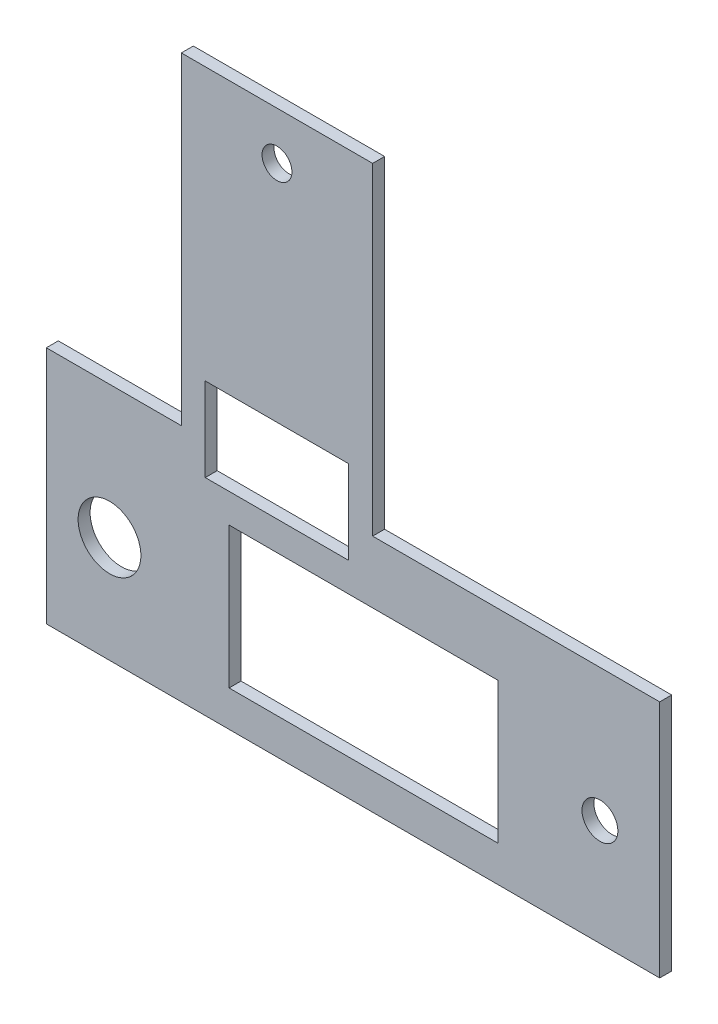
ISO-10303-21;
HEADER;
FILE_DESCRIPTION(('STEP AP214'),'2;1');
FILE_NAME('part.step','',(''),(''),'','','');
FILE_SCHEMA(('AUTOMOTIVE_DESIGN { 1 0 10303 214 1 1 1 1 }'));
ENDSEC;
DATA;
#1=APPLICATION_CONTEXT('core data for automotive mechanical design processes');
#2=APPLICATION_PROTOCOL_DEFINITION('international standard','automotive_design',2000,#1);
#3=PRODUCT_CONTEXT('',#1,'mechanical');
#4=PRODUCT('Part','Part','',(#3));
#5=PRODUCT_RELATED_PRODUCT_CATEGORY('part','',(#4));
#6=PRODUCT_DEFINITION_FORMATION('','',#4);
#7=PRODUCT_DEFINITION_CONTEXT('part definition',#1,'design');
#8=PRODUCT_DEFINITION('design','',#6,#7);
#9=PRODUCT_DEFINITION_SHAPE('','',#8);
#10=(LENGTH_UNIT() NAMED_UNIT(*) SI_UNIT(.MILLI.,.METRE.));
#11=(NAMED_UNIT(*) PLANE_ANGLE_UNIT() SI_UNIT($,.RADIAN.));
#12=(NAMED_UNIT(*) SI_UNIT($,.STERADIAN.) SOLID_ANGLE_UNIT());
#13=UNCERTAINTY_MEASURE_WITH_UNIT(LENGTH_MEASURE(1.E-05),#10,'distance_accuracy_value','');
#14=(GEOMETRIC_REPRESENTATION_CONTEXT(3) GLOBAL_UNCERTAINTY_ASSIGNED_CONTEXT((#13)) GLOBAL_UNIT_ASSIGNED_CONTEXT((#10,
#11,#12)) REPRESENTATION_CONTEXT('',''));
#15=CARTESIAN_POINT('',(0.,0.,0.));
#16=DIRECTION('',(0.,0.,1.));
#17=DIRECTION('',(1.,0.,0.));
#18=AXIS2_PLACEMENT_3D('',#15,#16,#17);
#19=CARTESIAN_POINT('',(0.,0.,1.));
#20=DIRECTION('',(0.,0.,1.));
#21=DIRECTION('',(1.,0.,0.));
#22=AXIS2_PLACEMENT_3D('',#19,#20,#21);
#23=PLANE('',#22);
#24=CARTESIAN_POINT('',(-5.32391187167302,-2.59514563106795,1.));
#25=DIRECTION('',(0.,0.,1.));
#26=DIRECTION('',(1.,0.,0.));
#27=AXIS2_PLACEMENT_3D('',#24,#25,#26);
#28=CIRCLE('',#27,2.625);
#29=CARTESIAN_POINT('',(-2.69891187167302,-2.59514563106795,1.));
#30=VERTEX_POINT('',#29);
#31=EDGE_CURVE('E397',#30,#30,#28,.T.);
#32=ORIENTED_EDGE('',*,*,#31,.F.);
#33=EDGE_LOOP('',(#32));
#34=FACE_BOUND('',#33,.T.);
#35=DIRECTION('',(1.,0.,0.));
#36=VECTOR('',#35,1.);
#37=CARTESIAN_POINT('',(2.68290648419213,5.74613247394495,1.));
#38=LINE('',#37,#36);
#39=CARTESIAN_POINT('',(2.68290648419213,5.74613247394495,1.));
#40=VERTEX_POINT('',#39);
#41=CARTESIAN_POINT('',(14.6829064841921,5.74613247394495,1.));
#42=VERTEX_POINT('',#41);
#43=EDGE_CURVE('E155',#40,#42,#38,.T.);
#44=ORIENTED_EDGE('',*,*,#43,.F.);
#45=DIRECTION('',(0.,-1.,0.));
#46=VECTOR('',#45,1.);
#47=CARTESIAN_POINT('',(2.68290648419213,12.746132473945,1.));
#48=LINE('',#47,#46);
#49=CARTESIAN_POINT('',(2.68290648419213,12.746132473945,1.));
#50=VERTEX_POINT('',#49);
#51=EDGE_CURVE('E147',#50,#40,#48,.T.);
#52=ORIENTED_EDGE('',*,*,#51,.F.);
#53=DIRECTION('',(-1.,0.,0.));
#54=VECTOR('',#53,1.);
#55=CARTESIAN_POINT('',(2.68290648419213,12.746132473945,1.));
#56=LINE('',#55,#54);
#57=CARTESIAN_POINT('',(14.6829064841921,12.746132473945,1.));
#58=VERTEX_POINT('',#57);
#59=EDGE_CURVE('E170',#58,#50,#56,.T.);
#60=ORIENTED_EDGE('',*,*,#59,.F.);
#61=DIRECTION('',(0.,1.,0.));
#62=VECTOR('',#61,1.);
#63=CARTESIAN_POINT('',(14.6829064841921,12.746132473945,1.));
#64=LINE('',#63,#62);
#65=EDGE_CURVE('E168',#42,#58,#64,.T.);
#66=ORIENTED_EDGE('',*,*,#65,.F.);
#67=EDGE_LOOP('',(#44,#52,#60,#66));
#68=FACE_BOUND('',#67,.T.);
#69=DIRECTION('',(1.,0.,0.));
#70=VECTOR('',#69,1.);
#71=CARTESIAN_POINT('',(4.67608812832698,-8.49514563106795,1.));
#72=LINE('',#71,#70);
#73=CARTESIAN_POINT('',(4.67608812832698,-8.49514563106795,1.));
#74=VERTEX_POINT('',#73);
#75=CARTESIAN_POINT('',(27.176088128327,-8.49514563106795,1.));
#76=VERTEX_POINT('',#75);
#77=EDGE_CURVE('E188',#74,#76,#72,.T.);
#78=ORIENTED_EDGE('',*,*,#77,.F.);
#79=DIRECTION('',(0.,-1.,0.));
#80=VECTOR('',#79,1.);
#81=CARTESIAN_POINT('',(4.67608812832698,3.30485436893205,1.));
#82=LINE('',#81,#80);
#83=CARTESIAN_POINT('',(4.67608812832698,3.30485436893205,1.));
#84=VERTEX_POINT('',#83);
#85=EDGE_CURVE('E186',#84,#74,#82,.T.);
#86=ORIENTED_EDGE('',*,*,#85,.F.);
#87=DIRECTION('',(-1.,0.,0.));
#88=VECTOR('',#87,1.);
#89=CARTESIAN_POINT('',(4.67608812832698,3.30485436893205,1.));
#90=LINE('',#89,#88);
#91=CARTESIAN_POINT('',(27.176088128327,3.30485436893205,1.));
#92=VERTEX_POINT('',#91);
#93=EDGE_CURVE('E194',#92,#84,#90,.T.);
#94=ORIENTED_EDGE('',*,*,#93,.F.);
#95=DIRECTION('',(0.,1.,0.));
#96=VECTOR('',#95,1.);
#97=CARTESIAN_POINT('',(27.176088128327,3.30485436893205,1.));
#98=LINE('',#97,#96);
#99=EDGE_CURVE('E191',#76,#92,#98,.T.);
#100=ORIENTED_EDGE('',*,*,#99,.F.);
#101=EDGE_LOOP('',(#78,#86,#94,#100));
#102=FACE_BOUND('',#101,.T.);
#103=DIRECTION('',(0.,-1.,0.));
#104=VECTOR('',#103,1.);
#105=CARTESIAN_POINT('',(-10.6070935158079,8.50485436893205,1.));
#106=LINE('',#105,#104);
#107=CARTESIAN_POINT('',(-10.6070935158079,8.50485436893205,1.));
#108=VERTEX_POINT('',#107);
#109=CARTESIAN_POINT('',(-10.6070935158079,-11.495145631068,1.));
#110=VERTEX_POINT('',#109);
#111=EDGE_CURVE('E217',#108,#110,#106,.T.);
#112=ORIENTED_EDGE('',*,*,#111,.T.);
#113=DIRECTION('',(1.,0.,0.));
#114=VECTOR('',#113,1.);
#115=CARTESIAN_POINT('',(-10.6070935158079,-11.495145631068,1.));
#116=LINE('',#115,#114);
#117=CARTESIAN_POINT('',(40.690737833595,-11.495145631068,1.));
#118=VERTEX_POINT('',#117);
#119=EDGE_CURVE('E220',#110,#118,#116,.T.);
#120=ORIENTED_EDGE('',*,*,#119,.T.);
#121=DIRECTION('',(0.,1.,0.));
#122=VECTOR('',#121,1.);
#123=CARTESIAN_POINT('',(40.690737833595,8.50485436893206,1.));
#124=LINE('',#123,#122);
#125=CARTESIAN_POINT('',(40.690737833595,8.50485436893206,1.));
#126=VERTEX_POINT('',#125);
#127=EDGE_CURVE('E223',#118,#126,#124,.T.);
#128=ORIENTED_EDGE('',*,*,#127,.T.);
#129=DIRECTION('',(-1.,0.,0.));
#130=VECTOR('',#129,1.);
#131=CARTESIAN_POINT('',(16.6829064841921,8.50485436893205,1.));
#132=LINE('',#131,#130);
#133=CARTESIAN_POINT('',(16.6829064841921,8.50485436893205,1.));
#134=VERTEX_POINT('',#133);
#135=EDGE_CURVE('E225',#126,#134,#132,.T.);
#136=ORIENTED_EDGE('',*,*,#135,.T.);
#137=DIRECTION('',(0.,1.,0.));
#138=VECTOR('',#137,1.);
#139=CARTESIAN_POINT('',(16.6829064841921,35.5048543689321,1.));
#140=LINE('',#139,#138);
#141=CARTESIAN_POINT('',(16.6829064841921,35.5048543689321,1.));
#142=VERTEX_POINT('',#141);
#143=EDGE_CURVE('E227',#134,#142,#140,.T.);
#144=ORIENTED_EDGE('',*,*,#143,.T.);
#145=DIRECTION('',(-1.,0.,0.));
#146=VECTOR('',#145,1.);
#147=CARTESIAN_POINT('',(0.682906484192128,35.5048543689321,1.));
#148=LINE('',#147,#146);
#149=CARTESIAN_POINT('',(0.682906484192128,35.5048543689321,1.));
#150=VERTEX_POINT('',#149);
#151=EDGE_CURVE('E229',#142,#150,#148,.T.);
#152=ORIENTED_EDGE('',*,*,#151,.T.);
#153=DIRECTION('',(0.,-1.,0.));
#154=VECTOR('',#153,1.);
#155=CARTESIAN_POINT('',(0.682906484192128,8.50485436893205,1.));
#156=LINE('',#155,#154);
#157=CARTESIAN_POINT('',(0.682906484192128,8.50485436893205,1.));
#158=VERTEX_POINT('',#157);
#159=EDGE_CURVE('E231',#150,#158,#156,.T.);
#160=ORIENTED_EDGE('',*,*,#159,.T.);
#161=DIRECTION('',(-1.,0.,0.));
#162=VECTOR('',#161,1.);
#163=CARTESIAN_POINT('',(-10.6070935158079,8.50485436893205,1.));
#164=LINE('',#163,#162);
#165=EDGE_CURVE('E233',#158,#108,#164,.T.);
#166=ORIENTED_EDGE('',*,*,#165,.T.);
#167=EDGE_LOOP('',(#112,#120,#128,#136,#144,#152,#160,#166));
#168=FACE_BOUND('',#167,.T.);
#169=CARTESIAN_POINT('',(8.68290648419213,31.5048543689321,1.));
#170=DIRECTION('',(0.,0.,1.));
#171=DIRECTION('',(1.,0.,0.));
#172=AXIS2_PLACEMENT_3D('',#169,#170,#171);
#173=CIRCLE('',#172,1.25);
#174=CARTESIAN_POINT('',(9.93290648419213,31.5048543689321,1.));
#175=VERTEX_POINT('',#174);
#176=EDGE_CURVE('E176',#175,#175,#173,.T.);
#177=ORIENTED_EDGE('',*,*,#176,.F.);
#178=EDGE_LOOP('',(#177));
#179=FACE_BOUND('',#178,.T.);
#180=CARTESIAN_POINT('',(35.690737833595,-2.59514563106795,1.));
#181=DIRECTION('',(0.,0.,1.));
#182=DIRECTION('',(1.,0.,0.));
#183=AXIS2_PLACEMENT_3D('',#180,#181,#182);
#184=CIRCLE('',#183,1.5);
#185=CARTESIAN_POINT('',(37.190737833595,-2.59514563106795,1.));
#186=VERTEX_POINT('',#185);
#187=EDGE_CURVE('E388',#186,#186,#184,.T.);
#188=ORIENTED_EDGE('',*,*,#187,.F.);
#189=EDGE_LOOP('',(#188));
#190=FACE_BOUND('',#189,.T.);
#191=ADVANCED_FACE('F34',(#34,#68,#102,#168,#179,#190),#23,.T.);
#192=CARTESIAN_POINT('',(0.,0.,0.));
#193=DIRECTION('',(0.,0.,1.));
#194=DIRECTION('',(1.,0.,0.));
#195=AXIS2_PLACEMENT_3D('',#192,#193,#194);
#196=PLANE('',#195);
#197=DIRECTION('',(0.,-1.,0.));
#198=VECTOR('',#197,1.);
#199=CARTESIAN_POINT('',(4.67608812832698,3.30485436893205,0.));
#200=LINE('',#199,#198);
#201=CARTESIAN_POINT('',(4.67608812832698,3.30485436893205,0.));
#202=VERTEX_POINT('',#201);
#203=CARTESIAN_POINT('',(4.67608812832698,-8.49514563106795,0.));
#204=VERTEX_POINT('',#203);
#205=EDGE_CURVE('E163',#202,#204,#200,.T.);
#206=ORIENTED_EDGE('',*,*,#205,.T.);
#207=DIRECTION('',(1.,0.,0.));
#208=VECTOR('',#207,1.);
#209=CARTESIAN_POINT('',(4.67608812832698,-8.49514563106795,0.));
#210=LINE('',#209,#208);
#211=CARTESIAN_POINT('',(27.176088128327,-8.49514563106795,0.));
#212=VERTEX_POINT('',#211);
#213=EDGE_CURVE('E199',#204,#212,#210,.T.);
#214=ORIENTED_EDGE('',*,*,#213,.T.);
#215=DIRECTION('',(0.,1.,0.));
#216=VECTOR('',#215,1.);
#217=CARTESIAN_POINT('',(27.176088128327,3.30485436893205,0.));
#218=LINE('',#217,#216);
#219=CARTESIAN_POINT('',(27.176088128327,3.30485436893205,0.));
#220=VERTEX_POINT('',#219);
#221=EDGE_CURVE('E202',#212,#220,#218,.T.);
#222=ORIENTED_EDGE('',*,*,#221,.T.);
#223=DIRECTION('',(-1.,0.,0.));
#224=VECTOR('',#223,1.);
#225=CARTESIAN_POINT('',(4.67608812832698,3.30485436893205,0.));
#226=LINE('',#225,#224);
#227=EDGE_CURVE('E189',#220,#202,#226,.T.);
#228=ORIENTED_EDGE('',*,*,#227,.T.);
#229=EDGE_LOOP('',(#206,#214,#222,#228));
#230=FACE_BOUND('',#229,.T.);
#231=DIRECTION('',(0.,-1.,0.));
#232=VECTOR('',#231,1.);
#233=CARTESIAN_POINT('',(-10.6070935158079,8.50485436893205,0.));
#234=LINE('',#233,#232);
#235=CARTESIAN_POINT('',(-10.6070935158079,8.50485436893205,0.));
#236=VERTEX_POINT('',#235);
#237=CARTESIAN_POINT('',(-10.6070935158079,-11.495145631068,0.));
#238=VERTEX_POINT('',#237);
#239=EDGE_CURVE('E216',#236,#238,#234,.T.);
#240=ORIENTED_EDGE('',*,*,#239,.F.);
#241=DIRECTION('',(-1.,0.,0.));
#242=VECTOR('',#241,1.);
#243=CARTESIAN_POINT('',(-10.6070935158079,8.50485436893205,0.));
#244=LINE('',#243,#242);
#245=CARTESIAN_POINT('',(0.682906484192128,8.50485436893205,0.));
#246=VERTEX_POINT('',#245);
#247=EDGE_CURVE('E221',#246,#236,#244,.T.);
#248=ORIENTED_EDGE('',*,*,#247,.F.);
#249=DIRECTION('',(0.,-1.,0.));
#250=VECTOR('',#249,1.);
#251=CARTESIAN_POINT('',(0.682906484192128,8.50485436893205,0.));
#252=LINE('',#251,#250);
#253=CARTESIAN_POINT('',(0.682906484192128,35.5048543689321,0.));
#254=VERTEX_POINT('',#253);
#255=EDGE_CURVE('E248',#254,#246,#252,.T.);
#256=ORIENTED_EDGE('',*,*,#255,.F.);
#257=DIRECTION('',(-1.,0.,0.));
#258=VECTOR('',#257,1.);
#259=CARTESIAN_POINT('',(0.682906484192128,35.5048543689321,0.));
#260=LINE('',#259,#258);
#261=CARTESIAN_POINT('',(16.6829064841921,35.5048543689321,0.));
#262=VERTEX_POINT('',#261);
#263=EDGE_CURVE('E246',#262,#254,#260,.T.);
#264=ORIENTED_EDGE('',*,*,#263,.F.);
#265=DIRECTION('',(0.,1.,0.));
#266=VECTOR('',#265,1.);
#267=CARTESIAN_POINT('',(16.6829064841921,35.5048543689321,0.));
#268=LINE('',#267,#266);
#269=CARTESIAN_POINT('',(16.6829064841921,8.50485436893205,0.));
#270=VERTEX_POINT('',#269);
#271=EDGE_CURVE('E244',#270,#262,#268,.T.);
#272=ORIENTED_EDGE('',*,*,#271,.F.);
#273=DIRECTION('',(-1.,0.,0.));
#274=VECTOR('',#273,1.);
#275=CARTESIAN_POINT('',(16.6829064841921,8.50485436893205,0.));
#276=LINE('',#275,#274);
#277=CARTESIAN_POINT('',(40.690737833595,8.50485436893206,0.));
#278=VERTEX_POINT('',#277);
#279=EDGE_CURVE('E242',#278,#270,#276,.T.);
#280=ORIENTED_EDGE('',*,*,#279,.F.);
#281=DIRECTION('',(0.,1.,0.));
#282=VECTOR('',#281,1.);
#283=CARTESIAN_POINT('',(40.690737833595,8.50485436893206,0.));
#284=LINE('',#283,#282);
#285=CARTESIAN_POINT('',(40.690737833595,-11.495145631068,0.));
#286=VERTEX_POINT('',#285);
#287=EDGE_CURVE('E240',#286,#278,#284,.T.);
#288=ORIENTED_EDGE('',*,*,#287,.F.);
#289=DIRECTION('',(1.,0.,0.));
#290=VECTOR('',#289,1.);
#291=CARTESIAN_POINT('',(-10.6070935158079,-11.495145631068,0.));
#292=LINE('',#291,#290);
#293=EDGE_CURVE('E238',#238,#286,#292,.T.);
#294=ORIENTED_EDGE('',*,*,#293,.F.);
#295=EDGE_LOOP('',(#240,#248,#256,#264,#272,#280,#288,#294));
#296=FACE_BOUND('',#295,.T.);
#297=DIRECTION('',(0.,-1.,0.));
#298=VECTOR('',#297,1.);
#299=CARTESIAN_POINT('',(2.68290648419213,12.746132473945,0.));
#300=LINE('',#299,#298);
#301=CARTESIAN_POINT('',(2.68290648419213,12.746132473945,0.));
#302=VERTEX_POINT('',#301);
#303=CARTESIAN_POINT('',(2.68290648419213,5.74613247394495,0.));
#304=VERTEX_POINT('',#303);
#305=EDGE_CURVE('E57',#302,#304,#300,.T.);
#306=ORIENTED_EDGE('',*,*,#305,.T.);
#307=DIRECTION('',(1.,0.,0.));
#308=VECTOR('',#307,1.);
#309=CARTESIAN_POINT('',(2.68290648419213,5.74613247394495,0.));
#310=LINE('',#309,#308);
#311=CARTESIAN_POINT('',(14.6829064841921,5.74613247394495,0.));
#312=VERTEX_POINT('',#311);
#313=EDGE_CURVE('E162',#304,#312,#310,.T.);
#314=ORIENTED_EDGE('',*,*,#313,.T.);
#315=DIRECTION('',(0.,1.,0.));
#316=VECTOR('',#315,1.);
#317=CARTESIAN_POINT('',(14.6829064841921,12.746132473945,0.));
#318=LINE('',#317,#316);
#319=CARTESIAN_POINT('',(14.6829064841921,12.746132473945,0.));
#320=VERTEX_POINT('',#319);
#321=EDGE_CURVE('E178',#312,#320,#318,.T.);
#322=ORIENTED_EDGE('',*,*,#321,.T.);
#323=DIRECTION('',(-1.,0.,0.));
#324=VECTOR('',#323,1.);
#325=CARTESIAN_POINT('',(2.68290648419213,12.746132473945,0.));
#326=LINE('',#325,#324);
#327=EDGE_CURVE('E156',#320,#302,#326,.T.);
#328=ORIENTED_EDGE('',*,*,#327,.T.);
#329=EDGE_LOOP('',(#306,#314,#322,#328));
#330=FACE_BOUND('',#329,.T.);
#331=CARTESIAN_POINT('',(8.68290648419213,31.5048543689321,0.));
#332=DIRECTION('',(0.,0.,1.));
#333=DIRECTION('',(1.,0.,0.));
#334=AXIS2_PLACEMENT_3D('',#331,#332,#333);
#335=CIRCLE('',#334,1.25);
#336=CARTESIAN_POINT('',(9.93290648419213,31.5048543689321,0.));
#337=VERTEX_POINT('',#336);
#338=EDGE_CURVE('E400',#337,#337,#335,.T.);
#339=ORIENTED_EDGE('',*,*,#338,.T.);
#340=EDGE_LOOP('',(#339));
#341=FACE_BOUND('',#340,.T.);
#342=CARTESIAN_POINT('',(-5.32391187167302,-2.59514563106795,0.));
#343=DIRECTION('',(0.,0.,1.));
#344=DIRECTION('',(1.,0.,0.));
#345=AXIS2_PLACEMENT_3D('',#342,#343,#344);
#346=CIRCLE('',#345,2.625);
#347=CARTESIAN_POINT('',(-2.69891187167302,-2.59514563106795,0.));
#348=VERTEX_POINT('',#347);
#349=EDGE_CURVE('E394',#348,#348,#346,.T.);
#350=ORIENTED_EDGE('',*,*,#349,.T.);
#351=EDGE_LOOP('',(#350));
#352=FACE_BOUND('',#351,.T.);
#353=CARTESIAN_POINT('',(35.690737833595,-2.59514563106795,0.));
#354=DIRECTION('',(0.,0.,1.));
#355=DIRECTION('',(1.,0.,0.));
#356=AXIS2_PLACEMENT_3D('',#353,#354,#355);
#357=CIRCLE('',#356,1.5);
#358=CARTESIAN_POINT('',(37.190737833595,-2.59514563106795,0.));
#359=VERTEX_POINT('',#358);
#360=EDGE_CURVE('E391',#359,#359,#357,.T.);
#361=ORIENTED_EDGE('',*,*,#360,.T.);
#362=EDGE_LOOP('',(#361));
#363=FACE_BOUND('',#362,.T.);
#364=ADVANCED_FACE('F278',(#230,#296,#330,#341,#352,#363),#196,.F.);
#365=CARTESIAN_POINT('',(-10.6070935158079,8.50485436893205,1.));
#366=DIRECTION('',(1.,0.,0.));
#367=DIRECTION('',(0.,1.,0.));
#368=AXIS2_PLACEMENT_3D('',#365,#366,#367);
#369=PLANE('',#368);
#370=ORIENTED_EDGE('',*,*,#239,.T.);
#371=DIRECTION('',(0.,0.,-1.));
#372=VECTOR('',#371,1.);
#373=CARTESIAN_POINT('',(-10.6070935158079,-11.495145631068,1.));
#374=LINE('',#373,#372);
#375=EDGE_CURVE('E11',#110,#238,#374,.T.);
#376=ORIENTED_EDGE('',*,*,#375,.F.);
#377=ORIENTED_EDGE('',*,*,#111,.F.);
#378=DIRECTION('',(0.,0.,-1.));
#379=VECTOR('',#378,1.);
#380=CARTESIAN_POINT('',(-10.6070935158079,8.50485436893205,1.));
#381=LINE('',#380,#379);
#382=EDGE_CURVE('E235',#108,#236,#381,.T.);
#383=ORIENTED_EDGE('',*,*,#382,.T.);
#384=EDGE_LOOP('',(#370,#376,#377,#383));
#385=FACE_BOUND('',#384,.T.);
#386=ADVANCED_FACE('F36',(#385),#369,.F.);
#387=CARTESIAN_POINT('',(-10.6070935158079,-11.495145631068,1.));
#388=DIRECTION('',(0.,1.,0.));
#389=DIRECTION('',(-1.,0.,0.));
#390=AXIS2_PLACEMENT_3D('',#387,#388,#389);
#391=PLANE('',#390);
#392=ORIENTED_EDGE('',*,*,#293,.T.);
#393=DIRECTION('',(0.,0.,-1.));
#394=VECTOR('',#393,1.);
#395=CARTESIAN_POINT('',(40.690737833595,-11.495145631068,1.));
#396=LINE('',#395,#394);
#397=EDGE_CURVE('E42',#118,#286,#396,.T.);
#398=ORIENTED_EDGE('',*,*,#397,.F.);
#399=ORIENTED_EDGE('',*,*,#119,.F.);
#400=ORIENTED_EDGE('',*,*,#375,.T.);
#401=EDGE_LOOP('',(#392,#398,#399,#400));
#402=FACE_BOUND('',#401,.T.);
#403=ADVANCED_FACE('F296',(#402),#391,.F.);
#404=CARTESIAN_POINT('',(40.690737833595,8.50485436893206,1.));
#405=DIRECTION('',(-1.,0.,0.));
#406=DIRECTION('',(0.,0.,1.));
#407=AXIS2_PLACEMENT_3D('',#404,#405,#406);
#408=PLANE('',#407);
#409=ORIENTED_EDGE('',*,*,#287,.T.);
#410=DIRECTION('',(0.,0.,-1.));
#411=VECTOR('',#410,1.);
#412=CARTESIAN_POINT('',(40.690737833595,8.50485436893206,1.));
#413=LINE('',#412,#411);
#414=EDGE_CURVE('E265',#126,#278,#413,.T.);
#415=ORIENTED_EDGE('',*,*,#414,.F.);
#416=ORIENTED_EDGE('',*,*,#127,.F.);
#417=ORIENTED_EDGE('',*,*,#397,.T.);
#418=EDGE_LOOP('',(#409,#415,#416,#417));
#419=FACE_BOUND('',#418,.T.);
#420=ADVANCED_FACE('F272',(#419),#408,.F.);
#421=CARTESIAN_POINT('',(16.6829064841921,8.50485436893205,1.));
#422=DIRECTION('',(0.,-1.,0.));
#423=DIRECTION('',(1.,0.,0.));
#424=AXIS2_PLACEMENT_3D('',#421,#422,#423);
#425=PLANE('',#424);
#426=ORIENTED_EDGE('',*,*,#279,.T.);
#427=DIRECTION('',(0.,0.,-1.));
#428=VECTOR('',#427,1.);
#429=CARTESIAN_POINT('',(16.6829064841921,8.50485436893205,1.));
#430=LINE('',#429,#428);
#431=EDGE_CURVE('E262',#134,#270,#430,.T.);
#432=ORIENTED_EDGE('',*,*,#431,.F.);
#433=ORIENTED_EDGE('',*,*,#135,.F.);
#434=ORIENTED_EDGE('',*,*,#414,.T.);
#435=EDGE_LOOP('',(#426,#432,#433,#434));
#436=FACE_BOUND('',#435,.T.);
#437=ADVANCED_FACE('F284',(#436),#425,.F.);
#438=CARTESIAN_POINT('',(16.6829064841921,35.5048543689321,1.));
#439=DIRECTION('',(-1.,0.,0.));
#440=DIRECTION('',(0.,0.,1.));
#441=AXIS2_PLACEMENT_3D('',#438,#439,#440);
#442=PLANE('',#441);
#443=ORIENTED_EDGE('',*,*,#271,.T.);
#444=DIRECTION('',(0.,0.,-1.));
#445=VECTOR('',#444,1.);
#446=CARTESIAN_POINT('',(16.6829064841921,35.5048543689321,1.));
#447=LINE('',#446,#445);
#448=EDGE_CURVE('E259',#142,#262,#447,.T.);
#449=ORIENTED_EDGE('',*,*,#448,.F.);
#450=ORIENTED_EDGE('',*,*,#143,.F.);
#451=ORIENTED_EDGE('',*,*,#431,.T.);
#452=EDGE_LOOP('',(#443,#449,#450,#451));
#453=FACE_BOUND('',#452,.T.);
#454=ADVANCED_FACE('F288',(#453),#442,.F.);
#455=CARTESIAN_POINT('',(0.682906484192128,35.5048543689321,1.));
#456=DIRECTION('',(0.,-1.,0.));
#457=DIRECTION('',(0.,0.,-1.));
#458=AXIS2_PLACEMENT_3D('',#455,#456,#457);
#459=PLANE('',#458);
#460=ORIENTED_EDGE('',*,*,#263,.T.);
#461=DIRECTION('',(0.,0.,-1.));
#462=VECTOR('',#461,1.);
#463=CARTESIAN_POINT('',(0.682906484192128,35.5048543689321,1.));
#464=LINE('',#463,#462);
#465=EDGE_CURVE('E256',#150,#254,#464,.T.);
#466=ORIENTED_EDGE('',*,*,#465,.F.);
#467=ORIENTED_EDGE('',*,*,#151,.F.);
#468=ORIENTED_EDGE('',*,*,#448,.T.);
#469=EDGE_LOOP('',(#460,#466,#467,#468));
#470=FACE_BOUND('',#469,.T.);
#471=ADVANCED_FACE('F309',(#470),#459,.F.);
#472=CARTESIAN_POINT('',(0.682906484192128,8.50485436893205,1.));
#473=DIRECTION('',(1.,0.,0.));
#474=DIRECTION('',(0.,0.,-1.));
#475=AXIS2_PLACEMENT_3D('',#472,#473,#474);
#476=PLANE('',#475);
#477=ORIENTED_EDGE('',*,*,#255,.T.);
#478=DIRECTION('',(0.,0.,-1.));
#479=VECTOR('',#478,1.);
#480=CARTESIAN_POINT('',(0.682906484192128,8.50485436893205,1.));
#481=LINE('',#480,#479);
#482=EDGE_CURVE('E253',#158,#246,#481,.T.);
#483=ORIENTED_EDGE('',*,*,#482,.F.);
#484=ORIENTED_EDGE('',*,*,#159,.F.);
#485=ORIENTED_EDGE('',*,*,#465,.T.);
#486=EDGE_LOOP('',(#477,#483,#484,#485));
#487=FACE_BOUND('',#486,.T.);
#488=ADVANCED_FACE('F307',(#487),#476,.F.);
#489=CARTESIAN_POINT('',(-10.6070935158079,8.50485436893205,1.));
#490=DIRECTION('',(0.,-1.,0.));
#491=DIRECTION('',(0.,0.,-1.));
#492=AXIS2_PLACEMENT_3D('',#489,#490,#491);
#493=PLANE('',#492);
#494=ORIENTED_EDGE('',*,*,#247,.T.);
#495=ORIENTED_EDGE('',*,*,#382,.F.);
#496=ORIENTED_EDGE('',*,*,#165,.F.);
#497=ORIENTED_EDGE('',*,*,#482,.T.);
#498=EDGE_LOOP('',(#494,#495,#496,#497));
#499=FACE_BOUND('',#498,.T.);
#500=ADVANCED_FACE('F302',(#499),#493,.F.);
#501=CARTESIAN_POINT('',(4.67608812832698,3.30485436893205,1.));
#502=DIRECTION('',(1.,0.,0.));
#503=DIRECTION('',(0.,1.,0.));
#504=AXIS2_PLACEMENT_3D('',#501,#502,#503);
#505=PLANE('',#504);
#506=ORIENTED_EDGE('',*,*,#205,.F.);
#507=DIRECTION('',(0.,0.,-1.));
#508=VECTOR('',#507,1.);
#509=CARTESIAN_POINT('',(4.67608812832698,3.30485436893205,1.));
#510=LINE('',#509,#508);
#511=EDGE_CURVE('E196',#84,#202,#510,.T.);
#512=ORIENTED_EDGE('',*,*,#511,.F.);
#513=ORIENTED_EDGE('',*,*,#85,.T.);
#514=DIRECTION('',(0.,0.,-1.));
#515=VECTOR('',#514,1.);
#516=CARTESIAN_POINT('',(4.67608812832698,-8.49514563106795,1.));
#517=LINE('',#516,#515);
#518=EDGE_CURVE('E213',#74,#204,#517,.T.);
#519=ORIENTED_EDGE('',*,*,#518,.T.);
#520=EDGE_LOOP('',(#506,#512,#513,#519));
#521=FACE_BOUND('',#520,.T.);
#522=ADVANCED_FACE('F328',(#521),#505,.T.);
#523=CARTESIAN_POINT('',(4.67608812832698,-8.49514563106795,1.));
#524=DIRECTION('',(0.,1.,0.));
#525=DIRECTION('',(0.,0.,1.));
#526=AXIS2_PLACEMENT_3D('',#523,#524,#525);
#527=PLANE('',#526);
#528=ORIENTED_EDGE('',*,*,#213,.F.);
#529=ORIENTED_EDGE('',*,*,#518,.F.);
#530=ORIENTED_EDGE('',*,*,#77,.T.);
#531=DIRECTION('',(0.,0.,-1.));
#532=VECTOR('',#531,1.);
#533=CARTESIAN_POINT('',(27.176088128327,-8.49514563106795,1.));
#534=LINE('',#533,#532);
#535=EDGE_CURVE('E211',#76,#212,#534,.T.);
#536=ORIENTED_EDGE('',*,*,#535,.T.);
#537=EDGE_LOOP('',(#528,#529,#530,#536));
#538=FACE_BOUND('',#537,.T.);
#539=ADVANCED_FACE('F335',(#538),#527,.T.);
#540=CARTESIAN_POINT('',(27.176088128327,3.30485436893205,1.));
#541=DIRECTION('',(-1.,0.,0.));
#542=DIRECTION('',(0.,0.,1.));
#543=AXIS2_PLACEMENT_3D('',#540,#541,#542);
#544=PLANE('',#543);
#545=ORIENTED_EDGE('',*,*,#221,.F.);
#546=ORIENTED_EDGE('',*,*,#535,.F.);
#547=ORIENTED_EDGE('',*,*,#99,.T.);
#548=DIRECTION('',(0.,0.,-1.));
#549=VECTOR('',#548,1.);
#550=CARTESIAN_POINT('',(27.176088128327,3.30485436893205,1.));
#551=LINE('',#550,#549);
#552=EDGE_CURVE('E209',#92,#220,#551,.T.);
#553=ORIENTED_EDGE('',*,*,#552,.T.);
#554=EDGE_LOOP('',(#545,#546,#547,#553));
#555=FACE_BOUND('',#554,.T.);
#556=ADVANCED_FACE('F340',(#555),#544,.T.);
#557=CARTESIAN_POINT('',(4.67608812832698,3.30485436893205,1.));
#558=DIRECTION('',(0.,-1.,0.));
#559=DIRECTION('',(0.,0.,-1.));
#560=AXIS2_PLACEMENT_3D('',#557,#558,#559);
#561=PLANE('',#560);
#562=ORIENTED_EDGE('',*,*,#227,.F.);
#563=ORIENTED_EDGE('',*,*,#552,.F.);
#564=ORIENTED_EDGE('',*,*,#93,.T.);
#565=ORIENTED_EDGE('',*,*,#511,.T.);
#566=EDGE_LOOP('',(#562,#563,#564,#565));
#567=FACE_BOUND('',#566,.T.);
#568=ADVANCED_FACE('F347',(#567),#561,.T.);
#569=CARTESIAN_POINT('',(2.68290648419213,12.746132473945,1.));
#570=DIRECTION('',(1.,0.,0.));
#571=DIRECTION('',(0.,1.,0.));
#572=AXIS2_PLACEMENT_3D('',#569,#570,#571);
#573=PLANE('',#572);
#574=ORIENTED_EDGE('',*,*,#305,.F.);
#575=DIRECTION('',(0.,0.,-1.));
#576=VECTOR('',#575,1.);
#577=CARTESIAN_POINT('',(2.68290648419213,12.746132473945,1.));
#578=LINE('',#577,#576);
#579=EDGE_CURVE('E151',#50,#302,#578,.T.);
#580=ORIENTED_EDGE('',*,*,#579,.F.);
#581=ORIENTED_EDGE('',*,*,#51,.T.);
#582=DIRECTION('',(0.,0.,-1.));
#583=VECTOR('',#582,1.);
#584=CARTESIAN_POINT('',(2.68290648419213,5.74613247394495,1.));
#585=LINE('',#584,#583);
#586=EDGE_CURVE('E150',#40,#304,#585,.T.);
#587=ORIENTED_EDGE('',*,*,#586,.T.);
#588=EDGE_LOOP('',(#574,#580,#581,#587));
#589=FACE_BOUND('',#588,.T.);
#590=ADVANCED_FACE('F149',(#589),#573,.T.);
#591=CARTESIAN_POINT('',(2.68290648419213,5.74613247394495,1.));
#592=DIRECTION('',(0.,1.,0.));
#593=DIRECTION('',(0.,0.,1.));
#594=AXIS2_PLACEMENT_3D('',#591,#592,#593);
#595=PLANE('',#594);
#596=ORIENTED_EDGE('',*,*,#313,.F.);
#597=ORIENTED_EDGE('',*,*,#586,.F.);
#598=ORIENTED_EDGE('',*,*,#43,.T.);
#599=DIRECTION('',(0.,0.,-1.));
#600=VECTOR('',#599,1.);
#601=CARTESIAN_POINT('',(14.6829064841921,5.74613247394495,1.));
#602=LINE('',#601,#600);
#603=EDGE_CURVE('E164',#42,#312,#602,.T.);
#604=ORIENTED_EDGE('',*,*,#603,.T.);
#605=EDGE_LOOP('',(#596,#597,#598,#604));
#606=FACE_BOUND('',#605,.T.);
#607=ADVANCED_FACE('F159',(#606),#595,.T.);
#608=CARTESIAN_POINT('',(14.6829064841921,12.746132473945,1.));
#609=DIRECTION('',(-1.,0.,0.));
#610=DIRECTION('',(0.,0.,1.));
#611=AXIS2_PLACEMENT_3D('',#608,#609,#610);
#612=PLANE('',#611);
#613=ORIENTED_EDGE('',*,*,#321,.F.);
#614=ORIENTED_EDGE('',*,*,#603,.F.);
#615=ORIENTED_EDGE('',*,*,#65,.T.);
#616=DIRECTION('',(0.,0.,-1.));
#617=VECTOR('',#616,1.);
#618=CARTESIAN_POINT('',(14.6829064841921,12.746132473945,1.));
#619=LINE('',#618,#617);
#620=EDGE_CURVE('E49',#58,#320,#619,.T.);
#621=ORIENTED_EDGE('',*,*,#620,.T.);
#622=EDGE_LOOP('',(#613,#614,#615,#621));
#623=FACE_BOUND('',#622,.T.);
#624=ADVANCED_FACE('F365',(#623),#612,.T.);
#625=CARTESIAN_POINT('',(2.68290648419213,12.746132473945,1.));
#626=DIRECTION('',(0.,-1.,0.));
#627=DIRECTION('',(1.,0.,0.));
#628=AXIS2_PLACEMENT_3D('',#625,#626,#627);
#629=PLANE('',#628);
#630=ORIENTED_EDGE('',*,*,#327,.F.);
#631=ORIENTED_EDGE('',*,*,#620,.F.);
#632=ORIENTED_EDGE('',*,*,#59,.T.);
#633=ORIENTED_EDGE('',*,*,#579,.T.);
#634=EDGE_LOOP('',(#630,#631,#632,#633));
#635=FACE_BOUND('',#634,.T.);
#636=ADVANCED_FACE('F368',(#635),#629,.T.);
#637=CARTESIAN_POINT('',(8.68290648419213,31.5048543689321,1.));
#638=DIRECTION('',(0.,0.,-1.));
#639=DIRECTION('',(-1.,0.,0.));
#640=AXIS2_PLACEMENT_3D('',#637,#638,#639);
#641=CYLINDRICAL_SURFACE('',#640,1.25);
#642=ORIENTED_EDGE('',*,*,#176,.T.);
#643=EDGE_LOOP('',(#642));
#644=FACE_BOUND('',#643,.T.);
#645=ORIENTED_EDGE('',*,*,#338,.F.);
#646=EDGE_LOOP('',(#645));
#647=FACE_BOUND('',#646,.T.);
#648=ADVANCED_FACE('F372',(#644,#647),#641,.F.);
#649=CARTESIAN_POINT('',(-5.32391187167302,-2.59514563106795,1.));
#650=DIRECTION('',(0.,0.,-1.));
#651=DIRECTION('',(-1.,0.,0.));
#652=AXIS2_PLACEMENT_3D('',#649,#650,#651);
#653=CYLINDRICAL_SURFACE('',#652,2.625);
#654=ORIENTED_EDGE('',*,*,#31,.T.);
#655=EDGE_LOOP('',(#654));
#656=FACE_BOUND('',#655,.T.);
#657=ORIENTED_EDGE('',*,*,#349,.F.);
#658=EDGE_LOOP('',(#657));
#659=FACE_BOUND('',#658,.T.);
#660=ADVANCED_FACE('F375',(#656,#659),#653,.F.);
#661=CARTESIAN_POINT('',(35.690737833595,-2.59514563106795,1.));
#662=DIRECTION('',(0.,0.,-1.));
#663=DIRECTION('',(-1.,0.,0.));
#664=AXIS2_PLACEMENT_3D('',#661,#662,#663);
#665=CYLINDRICAL_SURFACE('',#664,1.5);
#666=ORIENTED_EDGE('',*,*,#187,.T.);
#667=EDGE_LOOP('',(#666));
#668=FACE_BOUND('',#667,.T.);
#669=ORIENTED_EDGE('',*,*,#360,.F.);
#670=EDGE_LOOP('',(#669));
#671=FACE_BOUND('',#670,.T.);
#672=ADVANCED_FACE('F379',(#668,#671),#665,.F.);
#673=CLOSED_SHELL('',(#191,#364,#386,#403,#420,#437,#454,#471,#488,#500,#522,#539,#556,#568,
#590,#607,#624,#636,#648,#660,#672));
#674=MANIFOLD_SOLID_BREP('B2',#673);
#675=ADVANCED_BREP_SHAPE_REPRESENTATION('',(#18,#674),#14);
#676=SHAPE_DEFINITION_REPRESENTATION(#9,#675);
ENDSEC;
END-ISO-10303-21;
